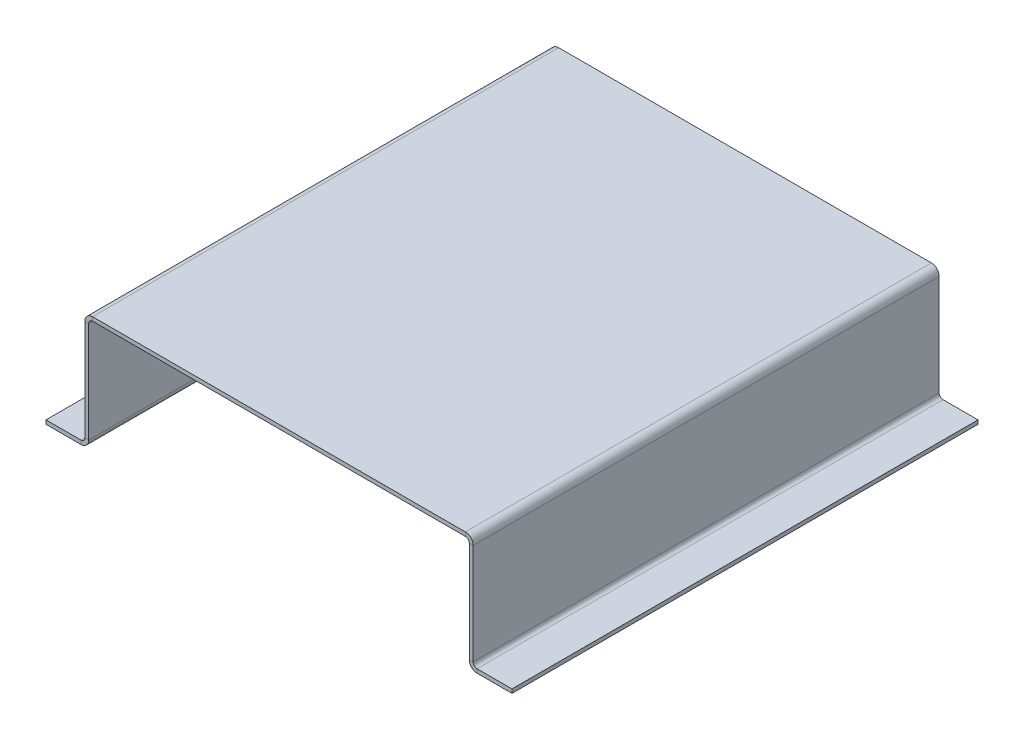
ISO-10303-21;
HEADER;
FILE_DESCRIPTION(('STEP AP214'),'2;1');
FILE_NAME('part.step','',(''),(''),'','','');
FILE_SCHEMA(('AUTOMOTIVE_DESIGN { 1 0 10303 214 1 1 1 1 }'));
ENDSEC;
DATA;
#1=APPLICATION_CONTEXT('core data for automotive mechanical design processes');
#2=APPLICATION_PROTOCOL_DEFINITION('international standard','automotive_design',2000,#1);
#3=PRODUCT_CONTEXT('',#1,'mechanical');
#4=PRODUCT('Part','Part','',(#3));
#5=PRODUCT_RELATED_PRODUCT_CATEGORY('part','',(#4));
#6=PRODUCT_DEFINITION_FORMATION('','',#4);
#7=PRODUCT_DEFINITION_CONTEXT('part definition',#1,'design');
#8=PRODUCT_DEFINITION('design','',#6,#7);
#9=PRODUCT_DEFINITION_SHAPE('','',#8);
#10=(LENGTH_UNIT() NAMED_UNIT(*) SI_UNIT(.MILLI.,.METRE.));
#11=(NAMED_UNIT(*) PLANE_ANGLE_UNIT() SI_UNIT($,.RADIAN.));
#12=(NAMED_UNIT(*) SI_UNIT($,.STERADIAN.) SOLID_ANGLE_UNIT());
#13=UNCERTAINTY_MEASURE_WITH_UNIT(LENGTH_MEASURE(1.E-05),#10,'distance_accuracy_value','');
#14=(GEOMETRIC_REPRESENTATION_CONTEXT(3) GLOBAL_UNCERTAINTY_ASSIGNED_CONTEXT((#13)) GLOBAL_UNIT_ASSIGNED_CONTEXT((#10,
#11,#12)) REPRESENTATION_CONTEXT('',''));
#15=CARTESIAN_POINT('',(0.,0.,0.));
#16=DIRECTION('',(0.,0.,1.));
#17=DIRECTION('',(1.,0.,0.));
#18=AXIS2_PLACEMENT_3D('',#15,#16,#17);
#19=CARTESIAN_POINT('',(62.23,36.83,0.));
#20=DIRECTION('',(0.,0.,1.));
#21=DIRECTION('',(0.,-1.,0.));
#22=AXIS2_PLACEMENT_3D('',#19,#20,#21);
#23=PLANE('',#22);
#24=DIRECTION('',(0.,1.,0.));
#25=VECTOR('',#24,1.);
#26=CARTESIAN_POINT('',(63.5,36.83,0.));
#27=LINE('',#26,#25);
#28=CARTESIAN_POINT('',(63.5,35.56,0.));
#29=VERTEX_POINT('',#28);
#30=CARTESIAN_POINT('',(63.5,2.54,0.));
#31=VERTEX_POINT('',#30);
#32=EDGE_CURVE('E111',#29,#31,#27,.F.);
#33=ORIENTED_EDGE('',*,*,#32,.T.);
#34=DIRECTION('',(1.,0.,0.));
#35=VECTOR('',#34,1.);
#36=CARTESIAN_POINT('',(62.23,2.54,-2.22044604925031E-13));
#37=LINE('',#36,#35);
#38=CARTESIAN_POINT('',(62.23,2.54,-2.22044604925031E-13));
#39=VERTEX_POINT('',#38);
#40=EDGE_CURVE('E322',#39,#31,#37,.T.);
#41=ORIENTED_EDGE('',*,*,#40,.F.);
#42=DIRECTION('',(0.,-1.,0.));
#43=VECTOR('',#42,1.);
#44=CARTESIAN_POINT('',(62.23,36.83,0.));
#45=LINE('',#44,#43);
#46=CARTESIAN_POINT('',(62.23,35.56,0.));
#47=VERTEX_POINT('',#46);
#48=EDGE_CURVE('E204',#47,#39,#45,.T.);
#49=ORIENTED_EDGE('',*,*,#48,.F.);
#50=DIRECTION('',(-1.,0.,0.));
#51=VECTOR('',#50,1.);
#52=CARTESIAN_POINT('',(62.23,35.56,0.));
#53=LINE('',#52,#51);
#54=EDGE_CURVE('E104',#29,#47,#53,.T.);
#55=ORIENTED_EDGE('',*,*,#54,.F.);
#56=EDGE_LOOP('',(#33,#41,#49,#55));
#57=FACE_BOUND('',#56,.T.);
#58=ADVANCED_FACE('F37',(#57),#23,.F.);
#59=CARTESIAN_POINT('',(62.23,36.83,152.4));
#60=DIRECTION('',(0.,0.,1.));
#61=DIRECTION('',(0.,-1.,0.));
#62=AXIS2_PLACEMENT_3D('',#59,#60,#61);
#63=PLANE('',#62);
#64=DIRECTION('',(0.,-1.,0.));
#65=VECTOR('',#64,1.);
#66=CARTESIAN_POINT('',(62.23,36.83,152.4));
#67=LINE('',#66,#65);
#68=CARTESIAN_POINT('',(62.23,35.56,152.4));
#69=VERTEX_POINT('',#68);
#70=CARTESIAN_POINT('',(62.23,2.54,152.4));
#71=VERTEX_POINT('',#70);
#72=EDGE_CURVE('E200',#69,#71,#67,.T.);
#73=ORIENTED_EDGE('',*,*,#72,.T.);
#74=DIRECTION('',(1.,0.,0.));
#75=VECTOR('',#74,1.);
#76=CARTESIAN_POINT('',(62.23,2.54,152.4));
#77=LINE('',#76,#75);
#78=CARTESIAN_POINT('',(63.5,2.54,152.4));
#79=VERTEX_POINT('',#78);
#80=EDGE_CURVE('E128',#71,#79,#77,.T.);
#81=ORIENTED_EDGE('',*,*,#80,.T.);
#82=DIRECTION('',(0.,1.,0.));
#83=VECTOR('',#82,1.);
#84=CARTESIAN_POINT('',(63.5,36.83,152.4));
#85=LINE('',#84,#83);
#86=CARTESIAN_POINT('',(63.5,35.56,152.4));
#87=VERTEX_POINT('',#86);
#88=EDGE_CURVE('E110',#87,#79,#85,.F.);
#89=ORIENTED_EDGE('',*,*,#88,.F.);
#90=DIRECTION('',(-1.,0.,0.));
#91=VECTOR('',#90,1.);
#92=CARTESIAN_POINT('',(62.23,35.56,152.4));
#93=LINE('',#92,#91);
#94=EDGE_CURVE('E41',#87,#69,#93,.T.);
#95=ORIENTED_EDGE('',*,*,#94,.T.);
#96=EDGE_LOOP('',(#73,#81,#89,#95));
#97=FACE_BOUND('',#96,.T.);
#98=ADVANCED_FACE('F126',(#97),#63,.T.);
#99=CARTESIAN_POINT('',(62.23,36.83,152.4));
#100=DIRECTION('',(1.,0.,0.));
#101=DIRECTION('',(0.,1.,0.));
#102=AXIS2_PLACEMENT_3D('',#99,#100,#101);
#103=PLANE('',#102);
#104=DIRECTION('',(0.,0.,1.));
#105=VECTOR('',#104,1.);
#106=CARTESIAN_POINT('',(62.23,2.54,-762.));
#107=LINE('',#106,#105);
#108=EDGE_CURVE('E869',#39,#71,#107,.T.);
#109=ORIENTED_EDGE('',*,*,#108,.T.);
#110=ORIENTED_EDGE('',*,*,#72,.F.);
#111=DIRECTION('',(0.,0.,-1.));
#112=VECTOR('',#111,1.);
#113=CARTESIAN_POINT('',(62.23,35.56,0.));
#114=LINE('',#113,#112);
#115=EDGE_CURVE('E202',#69,#47,#114,.T.);
#116=ORIENTED_EDGE('',*,*,#115,.T.);
#117=ORIENTED_EDGE('',*,*,#48,.T.);
#118=EDGE_LOOP('',(#109,#110,#116,#117));
#119=FACE_BOUND('',#118,.T.);
#120=ADVANCED_FACE('F225',(#119),#103,.F.);
#121=CARTESIAN_POINT('',(63.5,36.83,152.4));
#122=DIRECTION('',(1.,0.,0.));
#123=DIRECTION('',(0.,1.,0.));
#124=AXIS2_PLACEMENT_3D('',#121,#122,#123);
#125=PLANE('',#124);
#126=ORIENTED_EDGE('',*,*,#88,.T.);
#127=DIRECTION('',(0.,0.,1.));
#128=VECTOR('',#127,1.);
#129=CARTESIAN_POINT('',(63.5,2.54,-762.));
#130=LINE('',#129,#128);
#131=EDGE_CURVE('E53',#31,#79,#130,.T.);
#132=ORIENTED_EDGE('',*,*,#131,.F.);
#133=ORIENTED_EDGE('',*,*,#32,.F.);
#134=DIRECTION('',(0.,0.,1.));
#135=VECTOR('',#134,1.);
#136=CARTESIAN_POINT('',(63.5,35.56,152.4));
#137=LINE('',#136,#135);
#138=EDGE_CURVE('E107',#87,#29,#137,.F.);
#139=ORIENTED_EDGE('',*,*,#138,.F.);
#140=EDGE_LOOP('',(#126,#132,#133,#139));
#141=FACE_BOUND('',#140,.T.);
#142=ADVANCED_FACE('F108',(#141),#125,.T.);
#143=CARTESIAN_POINT('',(-62.23,36.83,152.4));
#144=DIRECTION('',(0.,0.,1.));
#145=DIRECTION('',(0.,1.,0.));
#146=AXIS2_PLACEMENT_3D('',#143,#144,#145);
#147=PLANE('',#146);
#148=DIRECTION('',(0.,1.,0.));
#149=VECTOR('',#148,1.);
#150=CARTESIAN_POINT('',(-63.5,36.83,152.4));
#151=LINE('',#150,#149);
#152=CARTESIAN_POINT('',(-63.5,2.54,152.4));
#153=VERTEX_POINT('',#152);
#154=CARTESIAN_POINT('',(-63.5,35.56,152.4));
#155=VERTEX_POINT('',#154);
#156=EDGE_CURVE('E133',#153,#155,#151,.T.);
#157=ORIENTED_EDGE('',*,*,#156,.F.);
#158=DIRECTION('',(1.,0.,0.));
#159=VECTOR('',#158,1.);
#160=CARTESIAN_POINT('',(-62.23,2.54,152.4));
#161=LINE('',#160,#159);
#162=CARTESIAN_POINT('',(-62.23,2.54,152.4));
#163=VERTEX_POINT('',#162);
#164=EDGE_CURVE('E365',#163,#153,#161,.F.);
#165=ORIENTED_EDGE('',*,*,#164,.F.);
#166=DIRECTION('',(0.,1.,0.));
#167=VECTOR('',#166,1.);
#168=CARTESIAN_POINT('',(-62.23,36.83,152.4));
#169=LINE('',#168,#167);
#170=CARTESIAN_POINT('',(-62.23,35.56,152.4));
#171=VERTEX_POINT('',#170);
#172=EDGE_CURVE('E413',#163,#171,#169,.T.);
#173=ORIENTED_EDGE('',*,*,#172,.T.);
#174=DIRECTION('',(1.,0.,0.));
#175=VECTOR('',#174,1.);
#176=CARTESIAN_POINT('',(-62.23,35.56,152.4));
#177=LINE('',#176,#175);
#178=EDGE_CURVE('E160',#155,#171,#177,.T.);
#179=ORIENTED_EDGE('',*,*,#178,.F.);
#180=EDGE_LOOP('',(#157,#165,#173,#179));
#181=FACE_BOUND('',#180,.T.);
#182=ADVANCED_FACE('F418',(#181),#147,.T.);
#183=CARTESIAN_POINT('',(-62.23,36.83,0.));
#184=DIRECTION('',(0.,0.,1.));
#185=DIRECTION('',(0.,1.,0.));
#186=AXIS2_PLACEMENT_3D('',#183,#184,#185);
#187=PLANE('',#186);
#188=DIRECTION('',(0.,1.,0.));
#189=VECTOR('',#188,1.);
#190=CARTESIAN_POINT('',(-62.23,36.83,0.));
#191=LINE('',#190,#189);
#192=CARTESIAN_POINT('',(-62.23,2.53999999999999,0.));
#193=VERTEX_POINT('',#192);
#194=CARTESIAN_POINT('',(-62.23,35.56,0.));
#195=VERTEX_POINT('',#194);
#196=EDGE_CURVE('E183',#193,#195,#191,.T.);
#197=ORIENTED_EDGE('',*,*,#196,.F.);
#198=DIRECTION('',(1.,0.,0.));
#199=VECTOR('',#198,1.);
#200=CARTESIAN_POINT('',(-62.23,2.54,0.));
#201=LINE('',#200,#199);
#202=CARTESIAN_POINT('',(-63.5,2.54,0.));
#203=VERTEX_POINT('',#202);
#204=EDGE_CURVE('E373',#193,#203,#201,.F.);
#205=ORIENTED_EDGE('',*,*,#204,.T.);
#206=DIRECTION('',(0.,1.,0.));
#207=VECTOR('',#206,1.);
#208=CARTESIAN_POINT('',(-63.5,36.83,0.));
#209=LINE('',#208,#207);
#210=CARTESIAN_POINT('',(-63.5,35.56,0.));
#211=VERTEX_POINT('',#210);
#212=EDGE_CURVE('E145',#203,#211,#209,.T.);
#213=ORIENTED_EDGE('',*,*,#212,.T.);
#214=DIRECTION('',(1.,0.,0.));
#215=VECTOR('',#214,1.);
#216=CARTESIAN_POINT('',(-62.23,35.56,0.));
#217=LINE('',#216,#215);
#218=EDGE_CURVE('E157',#211,#195,#217,.T.);
#219=ORIENTED_EDGE('',*,*,#218,.T.);
#220=EDGE_LOOP('',(#197,#205,#213,#219));
#221=FACE_BOUND('',#220,.T.);
#222=ADVANCED_FACE('F426',(#221),#187,.F.);
#223=CARTESIAN_POINT('',(-62.23,36.83,152.4));
#224=DIRECTION('',(-1.,0.,0.));
#225=DIRECTION('',(0.,0.,1.));
#226=AXIS2_PLACEMENT_3D('',#223,#224,#225);
#227=PLANE('',#226);
#228=DIRECTION('',(0.,0.,1.));
#229=VECTOR('',#228,1.);
#230=CARTESIAN_POINT('',(-62.23,2.54,-762.));
#231=LINE('',#230,#229);
#232=EDGE_CURVE('E354',#193,#163,#231,.T.);
#233=ORIENTED_EDGE('',*,*,#232,.F.);
#234=ORIENTED_EDGE('',*,*,#196,.T.);
#235=DIRECTION('',(0.,0.,-1.));
#236=VECTOR('',#235,1.);
#237=CARTESIAN_POINT('',(-62.23,35.56,152.4));
#238=LINE('',#237,#236);
#239=EDGE_CURVE('E199',#195,#171,#238,.F.);
#240=ORIENTED_EDGE('',*,*,#239,.T.);
#241=ORIENTED_EDGE('',*,*,#172,.F.);
#242=EDGE_LOOP('',(#233,#234,#240,#241));
#243=FACE_BOUND('',#242,.T.);
#244=ADVANCED_FACE('F422',(#243),#227,.F.);
#245=CARTESIAN_POINT('',(-63.5,36.83,152.4));
#246=DIRECTION('',(-1.,0.,0.));
#247=DIRECTION('',(0.,0.,1.));
#248=AXIS2_PLACEMENT_3D('',#245,#246,#247);
#249=PLANE('',#248);
#250=ORIENTED_EDGE('',*,*,#212,.F.);
#251=DIRECTION('',(0.,0.,1.));
#252=VECTOR('',#251,1.);
#253=CARTESIAN_POINT('',(-63.5,2.54,-762.));
#254=LINE('',#253,#252);
#255=EDGE_CURVE('E356',#203,#153,#254,.T.);
#256=ORIENTED_EDGE('',*,*,#255,.T.);
#257=ORIENTED_EDGE('',*,*,#156,.T.);
#258=DIRECTION('',(0.,0.,1.));
#259=VECTOR('',#258,1.);
#260=CARTESIAN_POINT('',(-63.5,35.56,152.4));
#261=LINE('',#260,#259);
#262=EDGE_CURVE('E116',#211,#155,#261,.T.);
#263=ORIENTED_EDGE('',*,*,#262,.F.);
#264=EDGE_LOOP('',(#250,#256,#257,#263));
#265=FACE_BOUND('',#264,.T.);
#266=ADVANCED_FACE('F462',(#265),#249,.T.);
#267=CARTESIAN_POINT('',(-62.23,36.83,152.4));
#268=DIRECTION('',(0.,0.,1.));
#269=DIRECTION('',(1.,0.,0.));
#270=AXIS2_PLACEMENT_3D('',#267,#268,#269);
#271=PLANE('',#270);
#272=DIRECTION('',(0.,-1.,0.));
#273=VECTOR('',#272,1.);
#274=CARTESIAN_POINT('',(60.96,36.83,152.4));
#275=LINE('',#274,#273);
#276=CARTESIAN_POINT('',(60.96,38.1,152.4));
#277=VERTEX_POINT('',#276);
#278=CARTESIAN_POINT('',(60.96,36.83,152.4));
#279=VERTEX_POINT('',#278);
#280=EDGE_CURVE('E11',#277,#279,#275,.T.);
#281=ORIENTED_EDGE('',*,*,#280,.F.);
#282=DIRECTION('',(1.,0.,0.));
#283=VECTOR('',#282,1.);
#284=CARTESIAN_POINT('',(-62.23,38.1,152.4));
#285=LINE('',#284,#283);
#286=CARTESIAN_POINT('',(-60.96,38.1,152.4));
#287=VERTEX_POINT('',#286);
#288=EDGE_CURVE('E141',#287,#277,#285,.T.);
#289=ORIENTED_EDGE('',*,*,#288,.F.);
#290=DIRECTION('',(0.,-1.,0.));
#291=VECTOR('',#290,1.);
#292=CARTESIAN_POINT('',(-60.96,36.83,152.4));
#293=LINE('',#292,#291);
#294=CARTESIAN_POINT('',(-60.96,36.83,152.4));
#295=VERTEX_POINT('',#294);
#296=EDGE_CURVE('E46',#287,#295,#293,.T.);
#297=ORIENTED_EDGE('',*,*,#296,.T.);
#298=DIRECTION('',(1.,0.,0.));
#299=VECTOR('',#298,1.);
#300=CARTESIAN_POINT('',(-62.23,36.83,152.4));
#301=LINE('',#300,#299);
#302=EDGE_CURVE('E170',#295,#279,#301,.T.);
#303=ORIENTED_EDGE('',*,*,#302,.T.);
#304=EDGE_LOOP('',(#281,#289,#297,#303));
#305=FACE_BOUND('',#304,.T.);
#306=ADVANCED_FACE('F169',(#305),#271,.T.);
#307=CARTESIAN_POINT('',(-60.96,35.56,152.4));
#308=DIRECTION('',(0.,0.,1.));
#309=DIRECTION('',(1.,0.,0.));
#310=AXIS2_PLACEMENT_3D('',#307,#308,#309);
#311=PLANE('',#310);
#312=ORIENTED_EDGE('',*,*,#296,.F.);
#313=CARTESIAN_POINT('',(-60.96,35.56,152.4));
#314=DIRECTION('',(0.,0.,1.));
#315=DIRECTION('',(1.,0.,0.));
#316=AXIS2_PLACEMENT_3D('',#313,#314,#315);
#317=CIRCLE('',#316,2.54);
#318=EDGE_CURVE('E142',#287,#155,#317,.T.);
#319=ORIENTED_EDGE('',*,*,#318,.T.);
#320=ORIENTED_EDGE('',*,*,#178,.T.);
#321=CARTESIAN_POINT('',(-60.96,35.56,152.4));
#322=DIRECTION('',(0.,0.,-1.));
#323=DIRECTION('',(-1.,0.,0.));
#324=AXIS2_PLACEMENT_3D('',#321,#322,#323);
#325=CIRCLE('',#324,1.27);
#326=EDGE_CURVE('E187',#295,#171,#325,.F.);
#327=ORIENTED_EDGE('',*,*,#326,.F.);
#328=EDGE_LOOP('',(#312,#319,#320,#327));
#329=FACE_BOUND('',#328,.T.);
#330=ADVANCED_FACE('F188',(#329),#311,.T.);
#331=CARTESIAN_POINT('',(-60.96,35.56,0.));
#332=DIRECTION('',(0.,0.,-1.));
#333=DIRECTION('',(-1.,0.,0.));
#334=AXIS2_PLACEMENT_3D('',#331,#332,#333);
#335=PLANE('',#334);
#336=ORIENTED_EDGE('',*,*,#218,.F.);
#337=CARTESIAN_POINT('',(-60.96,35.56,0.));
#338=DIRECTION('',(0.,0.,1.));
#339=DIRECTION('',(1.,0.,0.));
#340=AXIS2_PLACEMENT_3D('',#337,#338,#339);
#341=CIRCLE('',#340,2.54);
#342=CARTESIAN_POINT('',(-60.96,38.1,0.));
#343=VERTEX_POINT('',#342);
#344=EDGE_CURVE('E122',#211,#343,#341,.F.);
#345=ORIENTED_EDGE('',*,*,#344,.T.);
#346=DIRECTION('',(0.,-1.,0.));
#347=VECTOR('',#346,1.);
#348=CARTESIAN_POINT('',(-60.96,36.83,0.));
#349=LINE('',#348,#347);
#350=CARTESIAN_POINT('',(-60.96,36.83,0.));
#351=VERTEX_POINT('',#350);
#352=EDGE_CURVE('E154',#343,#351,#349,.T.);
#353=ORIENTED_EDGE('',*,*,#352,.T.);
#354=CARTESIAN_POINT('',(-60.96,35.56,0.));
#355=DIRECTION('',(0.,0.,1.));
#356=DIRECTION('',(1.,0.,0.));
#357=AXIS2_PLACEMENT_3D('',#354,#355,#356);
#358=CIRCLE('',#357,1.27);
#359=EDGE_CURVE('E194',#195,#351,#358,.F.);
#360=ORIENTED_EDGE('',*,*,#359,.F.);
#361=EDGE_LOOP('',(#336,#345,#353,#360));
#362=FACE_BOUND('',#361,.T.);
#363=ADVANCED_FACE('F430',(#362),#335,.T.);
#364=CARTESIAN_POINT('',(-62.23,36.83,0.));
#365=DIRECTION('',(0.,0.,1.));
#366=DIRECTION('',(1.,0.,0.));
#367=AXIS2_PLACEMENT_3D('',#364,#365,#366);
#368=PLANE('',#367);
#369=ORIENTED_EDGE('',*,*,#352,.F.);
#370=DIRECTION('',(1.,0.,0.));
#371=VECTOR('',#370,1.);
#372=CARTESIAN_POINT('',(-62.23,38.1,0.));
#373=LINE('',#372,#371);
#374=CARTESIAN_POINT('',(60.96,38.1,0.));
#375=VERTEX_POINT('',#374);
#376=EDGE_CURVE('E139',#343,#375,#373,.T.);
#377=ORIENTED_EDGE('',*,*,#376,.T.);
#378=DIRECTION('',(0.,-1.,0.));
#379=VECTOR('',#378,1.);
#380=CARTESIAN_POINT('',(60.96,36.83,0.));
#381=LINE('',#380,#379);
#382=CARTESIAN_POINT('',(60.96,36.83,0.));
#383=VERTEX_POINT('',#382);
#384=EDGE_CURVE('E62',#375,#383,#381,.T.);
#385=ORIENTED_EDGE('',*,*,#384,.T.);
#386=DIRECTION('',(1.,0.,0.));
#387=VECTOR('',#386,1.);
#388=CARTESIAN_POINT('',(-62.23,36.83,0.));
#389=LINE('',#388,#387);
#390=EDGE_CURVE('E184',#351,#383,#389,.T.);
#391=ORIENTED_EDGE('',*,*,#390,.F.);
#392=EDGE_LOOP('',(#369,#377,#385,#391));
#393=FACE_BOUND('',#392,.T.);
#394=ADVANCED_FACE('F432',(#393),#368,.F.);
#395=CARTESIAN_POINT('',(60.96,35.56,0.));
#396=DIRECTION('',(0.,0.,-1.));
#397=DIRECTION('',(-1.,0.,0.));
#398=AXIS2_PLACEMENT_3D('',#395,#396,#397);
#399=PLANE('',#398);
#400=ORIENTED_EDGE('',*,*,#384,.F.);
#401=CARTESIAN_POINT('',(60.96,35.56,0.));
#402=DIRECTION('',(0.,0.,1.));
#403=DIRECTION('',(1.,0.,0.));
#404=AXIS2_PLACEMENT_3D('',#401,#402,#403);
#405=CIRCLE('',#404,2.54);
#406=EDGE_CURVE('E123',#375,#29,#405,.F.);
#407=ORIENTED_EDGE('',*,*,#406,.T.);
#408=ORIENTED_EDGE('',*,*,#54,.T.);
#409=CARTESIAN_POINT('',(60.96,35.56,0.));
#410=DIRECTION('',(0.,0.,1.));
#411=DIRECTION('',(1.,0.,0.));
#412=AXIS2_PLACEMENT_3D('',#409,#410,#411);
#413=CIRCLE('',#412,1.27);
#414=EDGE_CURVE('E212',#383,#47,#413,.F.);
#415=ORIENTED_EDGE('',*,*,#414,.F.);
#416=EDGE_LOOP('',(#400,#407,#408,#415));
#417=FACE_BOUND('',#416,.T.);
#418=ADVANCED_FACE('F439',(#417),#399,.T.);
#419=CARTESIAN_POINT('',(60.96,35.56,152.4));
#420=DIRECTION('',(0.,0.,1.));
#421=DIRECTION('',(1.,0.,0.));
#422=AXIS2_PLACEMENT_3D('',#419,#420,#421);
#423=PLANE('',#422);
#424=CARTESIAN_POINT('',(60.96,35.56,152.4));
#425=DIRECTION('',(0.,0.,1.));
#426=DIRECTION('',(1.,0.,0.));
#427=AXIS2_PLACEMENT_3D('',#424,#425,#426);
#428=CIRCLE('',#427,2.54);
#429=EDGE_CURVE('E97',#87,#277,#428,.T.);
#430=ORIENTED_EDGE('',*,*,#429,.T.);
#431=ORIENTED_EDGE('',*,*,#280,.T.);
#432=CARTESIAN_POINT('',(60.96,35.56,152.4));
#433=DIRECTION('',(0.,0.,-1.));
#434=DIRECTION('',(-1.,0.,0.));
#435=AXIS2_PLACEMENT_3D('',#432,#433,#434);
#436=CIRCLE('',#435,1.27);
#437=EDGE_CURVE('E99',#69,#279,#436,.F.);
#438=ORIENTED_EDGE('',*,*,#437,.F.);
#439=ORIENTED_EDGE('',*,*,#94,.F.);
#440=EDGE_LOOP('',(#430,#431,#438,#439));
#441=FACE_BOUND('',#440,.T.);
#442=ADVANCED_FACE('F39',(#441),#423,.T.);
#443=CARTESIAN_POINT('',(-62.23,36.83,152.4));
#444=DIRECTION('',(0.,1.,0.));
#445=DIRECTION('',(0.,0.,1.));
#446=AXIS2_PLACEMENT_3D('',#443,#444,#445);
#447=PLANE('',#446);
#448=ORIENTED_EDGE('',*,*,#390,.T.);
#449=DIRECTION('',(0.,0.,-1.));
#450=VECTOR('',#449,1.);
#451=CARTESIAN_POINT('',(60.96,36.83,152.4));
#452=LINE('',#451,#450);
#453=EDGE_CURVE('E105',#383,#279,#452,.F.);
#454=ORIENTED_EDGE('',*,*,#453,.T.);
#455=ORIENTED_EDGE('',*,*,#302,.F.);
#456=DIRECTION('',(0.,0.,-1.));
#457=VECTOR('',#456,1.);
#458=CARTESIAN_POINT('',(-60.96,36.83,0.));
#459=LINE('',#458,#457);
#460=EDGE_CURVE('E181',#295,#351,#459,.T.);
#461=ORIENTED_EDGE('',*,*,#460,.T.);
#462=EDGE_LOOP('',(#448,#454,#455,#461));
#463=FACE_BOUND('',#462,.T.);
#464=ADVANCED_FACE('F179',(#463),#447,.F.);
#465=CARTESIAN_POINT('',(-60.96,35.56,152.4));
#466=DIRECTION('',(0.,0.,1.));
#467=DIRECTION('',(1.,0.,0.));
#468=AXIS2_PLACEMENT_3D('',#465,#466,#467);
#469=CYLINDRICAL_SURFACE('',#468,1.27);
#470=ORIENTED_EDGE('',*,*,#326,.T.);
#471=ORIENTED_EDGE('',*,*,#239,.F.);
#472=ORIENTED_EDGE('',*,*,#359,.T.);
#473=ORIENTED_EDGE('',*,*,#460,.F.);
#474=EDGE_LOOP('',(#470,#471,#472,#473));
#475=FACE_BOUND('',#474,.T.);
#476=ADVANCED_FACE('F197',(#475),#469,.F.);
#477=CARTESIAN_POINT('',(60.96,35.56,152.4));
#478=DIRECTION('',(0.,0.,1.));
#479=DIRECTION('',(1.,0.,0.));
#480=AXIS2_PLACEMENT_3D('',#477,#478,#479);
#481=CYLINDRICAL_SURFACE('',#480,1.27);
#482=ORIENTED_EDGE('',*,*,#437,.T.);
#483=ORIENTED_EDGE('',*,*,#453,.F.);
#484=ORIENTED_EDGE('',*,*,#414,.T.);
#485=ORIENTED_EDGE('',*,*,#115,.F.);
#486=EDGE_LOOP('',(#482,#483,#484,#485));
#487=FACE_BOUND('',#486,.T.);
#488=ADVANCED_FACE('F218',(#487),#481,.F.);
#489=CARTESIAN_POINT('',(-62.23,38.1,152.4));
#490=DIRECTION('',(0.,1.,0.));
#491=DIRECTION('',(0.,0.,1.));
#492=AXIS2_PLACEMENT_3D('',#489,#490,#491);
#493=PLANE('',#492);
#494=ORIENTED_EDGE('',*,*,#376,.F.);
#495=DIRECTION('',(0.,0.,1.));
#496=VECTOR('',#495,1.);
#497=CARTESIAN_POINT('',(-60.96,38.1,152.4));
#498=LINE('',#497,#496);
#499=EDGE_CURVE('E129',#287,#343,#498,.F.);
#500=ORIENTED_EDGE('',*,*,#499,.F.);
#501=ORIENTED_EDGE('',*,*,#288,.T.);
#502=DIRECTION('',(0.,0.,1.));
#503=VECTOR('',#502,1.);
#504=CARTESIAN_POINT('',(60.96,38.1,152.4));
#505=LINE('',#504,#503);
#506=EDGE_CURVE('E115',#375,#277,#505,.T.);
#507=ORIENTED_EDGE('',*,*,#506,.F.);
#508=EDGE_LOOP('',(#494,#500,#501,#507));
#509=FACE_BOUND('',#508,.T.);
#510=ADVANCED_FACE('F438',(#509),#493,.T.);
#511=CARTESIAN_POINT('',(-60.96,35.56,152.4));
#512=DIRECTION('',(0.,0.,1.));
#513=DIRECTION('',(1.,0.,0.));
#514=AXIS2_PLACEMENT_3D('',#511,#512,#513);
#515=CYLINDRICAL_SURFACE('',#514,2.54);
#516=ORIENTED_EDGE('',*,*,#318,.F.);
#517=ORIENTED_EDGE('',*,*,#499,.T.);
#518=ORIENTED_EDGE('',*,*,#344,.F.);
#519=ORIENTED_EDGE('',*,*,#262,.T.);
#520=EDGE_LOOP('',(#516,#517,#518,#519));
#521=FACE_BOUND('',#520,.T.);
#522=ADVANCED_FACE('F436',(#521),#515,.T.);
#523=CARTESIAN_POINT('',(60.96,35.56,152.4));
#524=DIRECTION('',(0.,0.,1.));
#525=DIRECTION('',(1.,0.,0.));
#526=AXIS2_PLACEMENT_3D('',#523,#524,#525);
#527=CYLINDRICAL_SURFACE('',#526,2.54);
#528=ORIENTED_EDGE('',*,*,#429,.F.);
#529=ORIENTED_EDGE('',*,*,#138,.T.);
#530=ORIENTED_EDGE('',*,*,#406,.F.);
#531=ORIENTED_EDGE('',*,*,#506,.T.);
#532=EDGE_LOOP('',(#528,#529,#530,#531));
#533=FACE_BOUND('',#532,.T.);
#534=ADVANCED_FACE('F119',(#533),#527,.T.);
#535=CARTESIAN_POINT('',(-76.2,0.,0.));
#536=DIRECTION('',(1.,0.,0.));
#537=DIRECTION('',(0.,0.,1.));
#538=AXIS2_PLACEMENT_3D('',#535,#536,#537);
#539=PLANE('',#538);
#540=DIRECTION('',(0.,-1.,0.));
#541=VECTOR('',#540,1.);
#542=CARTESIAN_POINT('',(-76.2,0.,152.4));
#543=LINE('',#542,#541);
#544=CARTESIAN_POINT('',(-76.2,0.,152.4));
#545=VERTEX_POINT('',#544);
#546=CARTESIAN_POINT('',(-76.2,1.27,152.4));
#547=VERTEX_POINT('',#546);
#548=EDGE_CURVE('E138',#545,#547,#543,.F.);
#549=ORIENTED_EDGE('',*,*,#548,.T.);
#550=DIRECTION('',(0.,0.,-1.));
#551=VECTOR('',#550,1.);
#552=CARTESIAN_POINT('',(-76.2,1.27,0.));
#553=LINE('',#552,#551);
#554=CARTESIAN_POINT('',(-76.2,1.27,0.));
#555=VERTEX_POINT('',#554);
#556=EDGE_CURVE('E386',#555,#547,#553,.F.);
#557=ORIENTED_EDGE('',*,*,#556,.F.);
#558=DIRECTION('',(0.,-1.,0.));
#559=VECTOR('',#558,1.);
#560=CARTESIAN_POINT('',(-76.2,0.,0.));
#561=LINE('',#560,#559);
#562=CARTESIAN_POINT('',(-76.2,0.,0.));
#563=VERTEX_POINT('',#562);
#564=EDGE_CURVE('E404',#563,#555,#561,.F.);
#565=ORIENTED_EDGE('',*,*,#564,.F.);
#566=DIRECTION('',(0.,0.,1.));
#567=VECTOR('',#566,1.);
#568=CARTESIAN_POINT('',(-76.2,0.,0.));
#569=LINE('',#568,#567);
#570=EDGE_CURVE('E376',#563,#545,#569,.T.);
#571=ORIENTED_EDGE('',*,*,#570,.T.);
#572=EDGE_LOOP('',(#549,#557,#565,#571));
#573=FACE_BOUND('',#572,.T.);
#574=ADVANCED_FACE('F457',(#573),#539,.F.);
#575=CARTESIAN_POINT('',(-76.2,0.,0.));
#576=DIRECTION('',(0.,0.,-1.));
#577=DIRECTION('',(1.,0.,0.));
#578=AXIS2_PLACEMENT_3D('',#575,#576,#577);
#579=PLANE('',#578);
#580=ORIENTED_EDGE('',*,*,#564,.T.);
#581=DIRECTION('',(1.,0.,0.));
#582=VECTOR('',#581,1.);
#583=CARTESIAN_POINT('',(-76.2,1.27,0.));
#584=LINE('',#583,#582);
#585=CARTESIAN_POINT('',(-64.77,1.27,0.));
#586=VERTEX_POINT('',#585);
#587=EDGE_CURVE('E383',#555,#586,#584,.T.);
#588=ORIENTED_EDGE('',*,*,#587,.T.);
#589=DIRECTION('',(0.,-1.,0.));
#590=VECTOR('',#589,1.);
#591=CARTESIAN_POINT('',(-64.77,0.,0.));
#592=LINE('',#591,#590);
#593=CARTESIAN_POINT('',(-64.77,0.,0.));
#594=VERTEX_POINT('',#593);
#595=EDGE_CURVE('E401',#594,#586,#592,.F.);
#596=ORIENTED_EDGE('',*,*,#595,.F.);
#597=DIRECTION('',(1.,0.,0.));
#598=VECTOR('',#597,1.);
#599=CARTESIAN_POINT('',(-76.2,0.,0.));
#600=LINE('',#599,#598);
#601=EDGE_CURVE('E392',#563,#594,#600,.T.);
#602=ORIENTED_EDGE('',*,*,#601,.F.);
#603=EDGE_LOOP('',(#580,#588,#596,#602));
#604=FACE_BOUND('',#603,.T.);
#605=ADVANCED_FACE('F482',(#604),#579,.T.);
#606=CARTESIAN_POINT('',(-76.2,0.,152.4));
#607=DIRECTION('',(0.,0.,1.));
#608=DIRECTION('',(-1.,0.,0.));
#609=AXIS2_PLACEMENT_3D('',#606,#607,#608);
#610=PLANE('',#609);
#611=DIRECTION('',(-1.,0.,0.));
#612=VECTOR('',#611,1.);
#613=CARTESIAN_POINT('',(-76.2,0.,152.4));
#614=LINE('',#613,#612);
#615=CARTESIAN_POINT('',(-64.77,0.,152.4));
#616=VERTEX_POINT('',#615);
#617=EDGE_CURVE('E389',#616,#545,#614,.T.);
#618=ORIENTED_EDGE('',*,*,#617,.F.);
#619=DIRECTION('',(0.,-1.,0.));
#620=VECTOR('',#619,1.);
#621=CARTESIAN_POINT('',(-64.77,0.,152.4));
#622=LINE('',#621,#620);
#623=CARTESIAN_POINT('',(-64.77,1.27,152.4));
#624=VERTEX_POINT('',#623);
#625=EDGE_CURVE('E391',#616,#624,#622,.F.);
#626=ORIENTED_EDGE('',*,*,#625,.T.);
#627=DIRECTION('',(1.,0.,0.));
#628=VECTOR('',#627,1.);
#629=CARTESIAN_POINT('',(-76.2,1.27,152.4));
#630=LINE('',#629,#628);
#631=EDGE_CURVE('E382',#624,#547,#630,.F.);
#632=ORIENTED_EDGE('',*,*,#631,.T.);
#633=ORIENTED_EDGE('',*,*,#548,.F.);
#634=EDGE_LOOP('',(#618,#626,#632,#633));
#635=FACE_BOUND('',#634,.T.);
#636=ADVANCED_FACE('F478',(#635),#610,.T.);
#637=CARTESIAN_POINT('',(-76.2,1.27,0.));
#638=DIRECTION('',(0.,-1.,0.));
#639=DIRECTION('',(0.,0.,-1.));
#640=AXIS2_PLACEMENT_3D('',#637,#638,#639);
#641=PLANE('',#640);
#642=DIRECTION('',(0.,0.,-1.));
#643=VECTOR('',#642,1.);
#644=CARTESIAN_POINT('',(-64.77,1.27,0.));
#645=LINE('',#644,#643);
#646=EDGE_CURVE('E379',#586,#624,#645,.F.);
#647=ORIENTED_EDGE('',*,*,#646,.F.);
#648=ORIENTED_EDGE('',*,*,#587,.F.);
#649=ORIENTED_EDGE('',*,*,#556,.T.);
#650=ORIENTED_EDGE('',*,*,#631,.F.);
#651=EDGE_LOOP('',(#647,#648,#649,#650));
#652=FACE_BOUND('',#651,.T.);
#653=ADVANCED_FACE('F481',(#652),#641,.F.);
#654=CARTESIAN_POINT('',(-76.2,0.,0.));
#655=DIRECTION('',(0.,-1.,0.));
#656=DIRECTION('',(0.,0.,-1.));
#657=AXIS2_PLACEMENT_3D('',#654,#655,#656);
#658=PLANE('',#657);
#659=DIRECTION('',(0.,0.,1.));
#660=VECTOR('',#659,1.);
#661=CARTESIAN_POINT('',(-64.77,0.,0.));
#662=LINE('',#661,#660);
#663=EDGE_CURVE('E395',#594,#616,#662,.T.);
#664=ORIENTED_EDGE('',*,*,#663,.T.);
#665=ORIENTED_EDGE('',*,*,#617,.T.);
#666=ORIENTED_EDGE('',*,*,#570,.F.);
#667=ORIENTED_EDGE('',*,*,#601,.T.);
#668=EDGE_LOOP('',(#664,#665,#666,#667));
#669=FACE_BOUND('',#668,.T.);
#670=ADVANCED_FACE('F490',(#669),#658,.T.);
#671=CARTESIAN_POINT('',(-64.77,2.54,0.));
#672=DIRECTION('',(0.,0.,1.));
#673=DIRECTION('',(1.,0.,0.));
#674=AXIS2_PLACEMENT_3D('',#671,#672,#673);
#675=PLANE('',#674);
#676=ORIENTED_EDGE('',*,*,#595,.T.);
#677=CARTESIAN_POINT('',(-64.77,2.54,0.));
#678=DIRECTION('',(0.,0.,1.));
#679=DIRECTION('',(1.,0.,0.));
#680=AXIS2_PLACEMENT_3D('',#677,#678,#679);
#681=CIRCLE('',#680,1.27);
#682=EDGE_CURVE('E359',#586,#203,#681,.T.);
#683=ORIENTED_EDGE('',*,*,#682,.T.);
#684=ORIENTED_EDGE('',*,*,#204,.F.);
#685=CARTESIAN_POINT('',(-64.77,2.54,0.));
#686=DIRECTION('',(0.,0.,-1.));
#687=DIRECTION('',(-1.,0.,0.));
#688=AXIS2_PLACEMENT_3D('',#685,#686,#687);
#689=CIRCLE('',#688,2.54);
#690=EDGE_CURVE('E368',#594,#193,#689,.F.);
#691=ORIENTED_EDGE('',*,*,#690,.F.);
#692=EDGE_LOOP('',(#676,#683,#684,#691));
#693=FACE_BOUND('',#692,.T.);
#694=ADVANCED_FACE('F493',(#693),#675,.F.);
#695=CARTESIAN_POINT('',(-64.77,2.54,152.4));
#696=DIRECTION('',(0.,0.,-1.));
#697=DIRECTION('',(-1.,0.,0.));
#698=AXIS2_PLACEMENT_3D('',#695,#696,#697);
#699=PLANE('',#698);
#700=CARTESIAN_POINT('',(-64.77,2.54,152.4));
#701=DIRECTION('',(0.,0.,1.));
#702=DIRECTION('',(1.,0.,0.));
#703=AXIS2_PLACEMENT_3D('',#700,#701,#702);
#704=CIRCLE('',#703,2.54);
#705=EDGE_CURVE('E360',#163,#616,#704,.F.);
#706=ORIENTED_EDGE('',*,*,#705,.F.);
#707=ORIENTED_EDGE('',*,*,#164,.T.);
#708=CARTESIAN_POINT('',(-64.77,2.54,152.4));
#709=DIRECTION('',(0.,0.,1.));
#710=DIRECTION('',(1.,0.,0.));
#711=AXIS2_PLACEMENT_3D('',#708,#709,#710);
#712=CIRCLE('',#711,1.27);
#713=EDGE_CURVE('E363',#153,#624,#712,.F.);
#714=ORIENTED_EDGE('',*,*,#713,.T.);
#715=ORIENTED_EDGE('',*,*,#625,.F.);
#716=EDGE_LOOP('',(#706,#707,#714,#715));
#717=FACE_BOUND('',#716,.T.);
#718=ADVANCED_FACE('F498',(#717),#699,.F.);
#719=CARTESIAN_POINT('',(-64.77,2.54,-762.));
#720=DIRECTION('',(0.,0.,1.));
#721=DIRECTION('',(1.,0.,0.));
#722=AXIS2_PLACEMENT_3D('',#719,#720,#721);
#723=CYLINDRICAL_SURFACE('',#722,1.27);
#724=ORIENTED_EDGE('',*,*,#255,.F.);
#725=ORIENTED_EDGE('',*,*,#682,.F.);
#726=ORIENTED_EDGE('',*,*,#646,.T.);
#727=ORIENTED_EDGE('',*,*,#713,.F.);
#728=EDGE_LOOP('',(#724,#725,#726,#727));
#729=FACE_BOUND('',#728,.T.);
#730=ADVANCED_FACE('F501',(#729),#723,.F.);
#731=CARTESIAN_POINT('',(-64.77,2.54,-762.));
#732=DIRECTION('',(0.,0.,1.));
#733=DIRECTION('',(1.,0.,0.));
#734=AXIS2_PLACEMENT_3D('',#731,#732,#733);
#735=CYLINDRICAL_SURFACE('',#734,2.54);
#736=ORIENTED_EDGE('',*,*,#232,.T.);
#737=ORIENTED_EDGE('',*,*,#705,.T.);
#738=ORIENTED_EDGE('',*,*,#663,.F.);
#739=ORIENTED_EDGE('',*,*,#690,.T.);
#740=EDGE_LOOP('',(#736,#737,#738,#739));
#741=FACE_BOUND('',#740,.T.);
#742=ADVANCED_FACE('F506',(#741),#735,.T.);
#743=CARTESIAN_POINT('',(76.2,0.,0.));
#744=DIRECTION('',(-1.,0.,0.));
#745=DIRECTION('',(0.,0.,1.));
#746=AXIS2_PLACEMENT_3D('',#743,#744,#745);
#747=PLANE('',#746);
#748=DIRECTION('',(0.,1.,0.));
#749=VECTOR('',#748,1.);
#750=CARTESIAN_POINT('',(76.2,0.,152.4));
#751=LINE('',#750,#749);
#752=CARTESIAN_POINT('',(76.2,0.,152.4));
#753=VERTEX_POINT('',#752);
#754=CARTESIAN_POINT('',(76.2,1.27,152.4));
#755=VERTEX_POINT('',#754);
#756=EDGE_CURVE('E352',#753,#755,#751,.T.);
#757=ORIENTED_EDGE('',*,*,#756,.F.);
#758=DIRECTION('',(0.,0.,1.));
#759=VECTOR('',#758,1.);
#760=CARTESIAN_POINT('',(76.2,0.,0.));
#761=LINE('',#760,#759);
#762=CARTESIAN_POINT('',(76.2,0.,0.));
#763=VERTEX_POINT('',#762);
#764=EDGE_CURVE('E345',#763,#753,#761,.T.);
#765=ORIENTED_EDGE('',*,*,#764,.F.);
#766=DIRECTION('',(0.,1.,0.));
#767=VECTOR('',#766,1.);
#768=CARTESIAN_POINT('',(76.2,0.,0.));
#769=LINE('',#768,#767);
#770=CARTESIAN_POINT('',(76.2,1.27,0.));
#771=VERTEX_POINT('',#770);
#772=EDGE_CURVE('E330',#763,#771,#769,.T.);
#773=ORIENTED_EDGE('',*,*,#772,.T.);
#774=DIRECTION('',(0.,0.,1.));
#775=VECTOR('',#774,1.);
#776=CARTESIAN_POINT('',(76.2,1.27,0.));
#777=LINE('',#776,#775);
#778=EDGE_CURVE('E336',#771,#755,#777,.T.);
#779=ORIENTED_EDGE('',*,*,#778,.T.);
#780=EDGE_LOOP('',(#757,#765,#773,#779));
#781=FACE_BOUND('',#780,.T.);
#782=ADVANCED_FACE('F509',(#781),#747,.F.);
#783=CARTESIAN_POINT('',(76.2,0.,0.));
#784=DIRECTION('',(0.,0.,-1.));
#785=DIRECTION('',(-1.,0.,0.));
#786=AXIS2_PLACEMENT_3D('',#783,#784,#785);
#787=PLANE('',#786);
#788=ORIENTED_EDGE('',*,*,#772,.F.);
#789=DIRECTION('',(-1.,0.,0.));
#790=VECTOR('',#789,1.);
#791=CARTESIAN_POINT('',(76.2,0.,0.));
#792=LINE('',#791,#790);
#793=CARTESIAN_POINT('',(64.77,0.,-2.22044604925031E-13));
#794=VERTEX_POINT('',#793);
#795=EDGE_CURVE('E329',#763,#794,#792,.T.);
#796=ORIENTED_EDGE('',*,*,#795,.T.);
#797=DIRECTION('',(0.,1.,0.));
#798=VECTOR('',#797,1.);
#799=CARTESIAN_POINT('',(64.77,0.,0.));
#800=LINE('',#799,#798);
#801=CARTESIAN_POINT('',(64.77,1.27,-4.44089209850063E-13));
#802=VERTEX_POINT('',#801);
#803=EDGE_CURVE('E320',#794,#802,#800,.T.);
#804=ORIENTED_EDGE('',*,*,#803,.T.);
#805=DIRECTION('',(-1.,0.,0.));
#806=VECTOR('',#805,1.);
#807=CARTESIAN_POINT('',(76.2,1.27,0.));
#808=LINE('',#807,#806);
#809=EDGE_CURVE('E313',#771,#802,#808,.T.);
#810=ORIENTED_EDGE('',*,*,#809,.F.);
#811=EDGE_LOOP('',(#788,#796,#804,#810));
#812=FACE_BOUND('',#811,.T.);
#813=ADVANCED_FACE('F327',(#812),#787,.T.);
#814=CARTESIAN_POINT('',(76.2,0.,152.4));
#815=DIRECTION('',(0.,0.,1.));
#816=DIRECTION('',(1.,0.,0.));
#817=AXIS2_PLACEMENT_3D('',#814,#815,#816);
#818=PLANE('',#817);
#819=DIRECTION('',(1.,0.,0.));
#820=VECTOR('',#819,1.);
#821=CARTESIAN_POINT('',(76.2,0.,152.4));
#822=LINE('',#821,#820);
#823=CARTESIAN_POINT('',(64.77,0.,152.4));
#824=VERTEX_POINT('',#823);
#825=EDGE_CURVE('E338',#824,#753,#822,.T.);
#826=ORIENTED_EDGE('',*,*,#825,.T.);
#827=ORIENTED_EDGE('',*,*,#756,.T.);
#828=DIRECTION('',(-1.,0.,0.));
#829=VECTOR('',#828,1.);
#830=CARTESIAN_POINT('',(76.2,1.27,152.4));
#831=LINE('',#830,#829);
#832=CARTESIAN_POINT('',(64.77,1.27,152.4));
#833=VERTEX_POINT('',#832);
#834=EDGE_CURVE('E312',#833,#755,#831,.F.);
#835=ORIENTED_EDGE('',*,*,#834,.F.);
#836=DIRECTION('',(0.,1.,0.));
#837=VECTOR('',#836,1.);
#838=CARTESIAN_POINT('',(64.77,0.,152.4));
#839=LINE('',#838,#837);
#840=EDGE_CURVE('E331',#824,#833,#839,.T.);
#841=ORIENTED_EDGE('',*,*,#840,.F.);
#842=EDGE_LOOP('',(#826,#827,#835,#841));
#843=FACE_BOUND('',#842,.T.);
#844=ADVANCED_FACE('F514',(#843),#818,.T.);
#845=CARTESIAN_POINT('',(76.2,1.27,0.));
#846=DIRECTION('',(0.,1.,0.));
#847=DIRECTION('',(-1.,0.,0.));
#848=AXIS2_PLACEMENT_3D('',#845,#846,#847);
#849=PLANE('',#848);
#850=DIRECTION('',(0.,0.,1.));
#851=VECTOR('',#850,1.);
#852=CARTESIAN_POINT('',(64.77,1.27,0.));
#853=LINE('',#852,#851);
#854=EDGE_CURVE('E301',#802,#833,#853,.T.);
#855=ORIENTED_EDGE('',*,*,#854,.T.);
#856=ORIENTED_EDGE('',*,*,#834,.T.);
#857=ORIENTED_EDGE('',*,*,#778,.F.);
#858=ORIENTED_EDGE('',*,*,#809,.T.);
#859=EDGE_LOOP('',(#855,#856,#857,#858));
#860=FACE_BOUND('',#859,.T.);
#861=ADVANCED_FACE('F334',(#860),#849,.T.);
#862=CARTESIAN_POINT('',(76.2,0.,0.));
#863=DIRECTION('',(0.,1.,0.));
#864=DIRECTION('',(-1.,0.,0.));
#865=AXIS2_PLACEMENT_3D('',#862,#863,#864);
#866=PLANE('',#865);
#867=DIRECTION('',(0.,0.,1.));
#868=VECTOR('',#867,1.);
#869=CARTESIAN_POINT('',(64.77,0.,0.));
#870=LINE('',#869,#868);
#871=EDGE_CURVE('E344',#794,#824,#870,.T.);
#872=ORIENTED_EDGE('',*,*,#871,.F.);
#873=ORIENTED_EDGE('',*,*,#795,.F.);
#874=ORIENTED_EDGE('',*,*,#764,.T.);
#875=ORIENTED_EDGE('',*,*,#825,.F.);
#876=EDGE_LOOP('',(#872,#873,#874,#875));
#877=FACE_BOUND('',#876,.T.);
#878=ADVANCED_FACE('F523',(#877),#866,.F.);
#879=CARTESIAN_POINT('',(64.77,2.54,0.));
#880=DIRECTION('',(0.,0.,1.));
#881=DIRECTION('',(1.,0.,0.));
#882=AXIS2_PLACEMENT_3D('',#879,#880,#881);
#883=PLANE('',#882);
#884=ORIENTED_EDGE('',*,*,#803,.F.);
#885=CARTESIAN_POINT('',(64.77,2.54,0.));
#886=DIRECTION('',(0.,0.,-1.));
#887=DIRECTION('',(-1.,0.,0.));
#888=AXIS2_PLACEMENT_3D('',#885,#886,#887);
#889=CIRCLE('',#888,2.54);
#890=EDGE_CURVE('E870',#794,#39,#889,.T.);
#891=ORIENTED_EDGE('',*,*,#890,.T.);
#892=ORIENTED_EDGE('',*,*,#40,.T.);
#893=CARTESIAN_POINT('',(64.77,2.54,-4.44089209850063E-13));
#894=DIRECTION('',(0.,0.,1.));
#895=DIRECTION('',(1.,0.,0.));
#896=AXIS2_PLACEMENT_3D('',#893,#894,#895);
#897=CIRCLE('',#896,1.27);
#898=EDGE_CURVE('E304',#802,#31,#897,.F.);
#899=ORIENTED_EDGE('',*,*,#898,.F.);
#900=EDGE_LOOP('',(#884,#891,#892,#899));
#901=FACE_BOUND('',#900,.T.);
#902=ADVANCED_FACE('F318',(#901),#883,.F.);
#903=CARTESIAN_POINT('',(64.77,2.54,152.4));
#904=DIRECTION('',(0.,0.,-1.));
#905=DIRECTION('',(-1.,0.,0.));
#906=AXIS2_PLACEMENT_3D('',#903,#904,#905);
#907=PLANE('',#906);
#908=CARTESIAN_POINT('',(64.77,2.54,152.4));
#909=DIRECTION('',(0.,0.,1.));
#910=DIRECTION('',(1.,0.,0.));
#911=AXIS2_PLACEMENT_3D('',#908,#909,#910);
#912=CIRCLE('',#911,2.54);
#913=EDGE_CURVE('E873',#71,#824,#912,.T.);
#914=ORIENTED_EDGE('',*,*,#913,.T.);
#915=ORIENTED_EDGE('',*,*,#840,.T.);
#916=CARTESIAN_POINT('',(64.77,2.54,152.4));
#917=DIRECTION('',(0.,0.,1.));
#918=DIRECTION('',(1.,0.,0.));
#919=AXIS2_PLACEMENT_3D('',#916,#917,#918);
#920=CIRCLE('',#919,1.27);
#921=EDGE_CURVE('E306',#79,#833,#920,.T.);
#922=ORIENTED_EDGE('',*,*,#921,.F.);
#923=ORIENTED_EDGE('',*,*,#80,.F.);
#924=EDGE_LOOP('',(#914,#915,#922,#923));
#925=FACE_BOUND('',#924,.T.);
#926=ADVANCED_FACE('F529',(#925),#907,.F.);
#927=CARTESIAN_POINT('',(64.77,2.54,-762.));
#928=DIRECTION('',(0.,0.,1.));
#929=DIRECTION('',(1.,0.,0.));
#930=AXIS2_PLACEMENT_3D('',#927,#928,#929);
#931=CYLINDRICAL_SURFACE('',#930,1.27);
#932=ORIENTED_EDGE('',*,*,#131,.T.);
#933=ORIENTED_EDGE('',*,*,#921,.T.);
#934=ORIENTED_EDGE('',*,*,#854,.F.);
#935=ORIENTED_EDGE('',*,*,#898,.T.);
#936=EDGE_LOOP('',(#932,#933,#934,#935));
#937=FACE_BOUND('',#936,.T.);
#938=ADVANCED_FACE('F303',(#937),#931,.F.);
#939=CARTESIAN_POINT('',(64.77,2.54,-762.));
#940=DIRECTION('',(0.,0.,1.));
#941=DIRECTION('',(1.,0.,0.));
#942=AXIS2_PLACEMENT_3D('',#939,#940,#941);
#943=CYLINDRICAL_SURFACE('',#942,2.54);
#944=ORIENTED_EDGE('',*,*,#108,.F.);
#945=ORIENTED_EDGE('',*,*,#890,.F.);
#946=ORIENTED_EDGE('',*,*,#871,.T.);
#947=ORIENTED_EDGE('',*,*,#913,.F.);
#948=EDGE_LOOP('',(#944,#945,#946,#947));
#949=FACE_BOUND('',#948,.T.);
#950=ADVANCED_FACE('F535',(#949),#943,.T.);
#951=CLOSED_SHELL('',(#58,#98,#120,#142,#182,#222,#244,#266,#306,#330,#363,#394,#418,#442,#464,
#476,#488,#510,#522,#534,#574,#605,#636,#653,#670,#694,#718,#730,#742,#782,#813,#844,#861,#878,
#902,#926,#938,#950));
#952=MANIFOLD_SOLID_BREP('B2',#951);
#953=ADVANCED_BREP_SHAPE_REPRESENTATION('',(#18,#952),#14);
#954=SHAPE_DEFINITION_REPRESENTATION(#9,#953);
ENDSEC;
END-ISO-10303-21;
